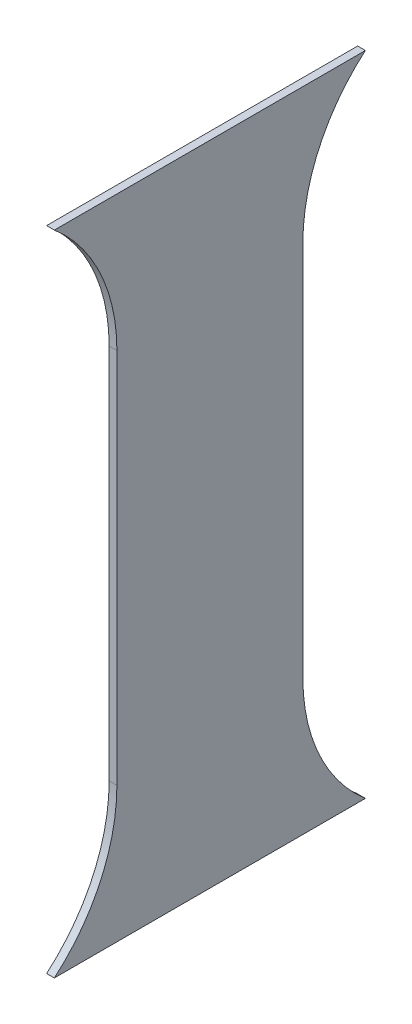
ISO-10303-21;
HEADER;
FILE_DESCRIPTION(('STEP AP214'),'2;1');
FILE_NAME('part.step','',(''),(''),'','','');
FILE_SCHEMA(('AUTOMOTIVE_DESIGN { 1 0 10303 214 1 1 1 1 }'));
ENDSEC;
DATA;
#1=APPLICATION_CONTEXT('core data for automotive mechanical design processes');
#2=APPLICATION_PROTOCOL_DEFINITION('international standard','automotive_design',2000,#1);
#3=PRODUCT_CONTEXT('',#1,'mechanical');
#4=PRODUCT('Part','Part','',(#3));
#5=PRODUCT_RELATED_PRODUCT_CATEGORY('part','',(#4));
#6=PRODUCT_DEFINITION_FORMATION('','',#4);
#7=PRODUCT_DEFINITION_CONTEXT('part definition',#1,'design');
#8=PRODUCT_DEFINITION('design','',#6,#7);
#9=PRODUCT_DEFINITION_SHAPE('','',#8);
#10=(LENGTH_UNIT() NAMED_UNIT(*) SI_UNIT(.MILLI.,.METRE.));
#11=(NAMED_UNIT(*) PLANE_ANGLE_UNIT() SI_UNIT($,.RADIAN.));
#12=(NAMED_UNIT(*) SI_UNIT($,.STERADIAN.) SOLID_ANGLE_UNIT());
#13=UNCERTAINTY_MEASURE_WITH_UNIT(LENGTH_MEASURE(1.E-05),#10,'distance_accuracy_value','');
#14=(GEOMETRIC_REPRESENTATION_CONTEXT(3) GLOBAL_UNCERTAINTY_ASSIGNED_CONTEXT((#13)) GLOBAL_UNIT_ASSIGNED_CONTEXT((#10,
#11,#12)) REPRESENTATION_CONTEXT('',''));
#15=CARTESIAN_POINT('',(0.,0.,0.));
#16=DIRECTION('',(0.,0.,1.));
#17=DIRECTION('',(1.,0.,0.));
#18=AXIS2_PLACEMENT_3D('',#15,#16,#17);
#19=CARTESIAN_POINT('',(20.,0.,460.));
#20=DIRECTION('',(-1.,0.,0.));
#21=DIRECTION('',(0.,0.,1.));
#22=AXIS2_PLACEMENT_3D('',#19,#20,#21);
#23=CYLINDRICAL_SURFACE('',#22,460.);
#24=CARTESIAN_POINT('',(0.,0.,460.));
#25=DIRECTION('',(-1.,0.,0.));
#26=DIRECTION('',(0.,0.,1.));
#27=AXIS2_PLACEMENT_3D('',#24,#25,#26);
#28=CIRCLE('',#27,460.);
#29=CARTESIAN_POINT('',(0.,0.,0.));
#30=VERTEX_POINT('',#29);
#31=CARTESIAN_POINT('',(0.,-350.,161.503768868014));
#32=VERTEX_POINT('',#31);
#33=EDGE_CURVE('E135',#30,#32,#28,.T.);
#34=ORIENTED_EDGE('',*,*,#33,.T.);
#35=DIRECTION('',(-1.,0.,0.));
#36=VECTOR('',#35,1.);
#37=CARTESIAN_POINT('',(20.,-350.,161.503768868014));
#38=LINE('',#37,#36);
#39=CARTESIAN_POINT('',(20.,-350.,161.503768868014));
#40=VERTEX_POINT('',#39);
#41=EDGE_CURVE('E59',#32,#40,#38,.F.);
#42=ORIENTED_EDGE('',*,*,#41,.T.);
#43=CARTESIAN_POINT('',(20.,0.,460.));
#44=DIRECTION('',(-1.,0.,0.));
#45=DIRECTION('',(0.,0.,1.));
#46=AXIS2_PLACEMENT_3D('',#43,#44,#45);
#47=CIRCLE('',#46,460.);
#48=CARTESIAN_POINT('',(20.,0.,0.));
#49=VERTEX_POINT('',#48);
#50=EDGE_CURVE('E115',#49,#40,#47,.T.);
#51=ORIENTED_EDGE('',*,*,#50,.F.);
#52=DIRECTION('',(-1.,0.,0.));
#53=VECTOR('',#52,1.);
#54=CARTESIAN_POINT('',(20.,0.,0.));
#55=LINE('',#54,#53);
#56=EDGE_CURVE('E134',#49,#30,#55,.T.);
#57=ORIENTED_EDGE('',*,*,#56,.T.);
#58=EDGE_LOOP('',(#34,#42,#51,#57));
#59=FACE_BOUND('',#58,.T.);
#60=ADVANCED_FACE('F38',(#59),#23,.F.);
#61=CARTESIAN_POINT('',(20.,0.,-940.));
#62=DIRECTION('',(-1.,0.,0.));
#63=DIRECTION('',(0.,0.,1.));
#64=AXIS2_PLACEMENT_3D('',#61,#62,#63);
#65=CYLINDRICAL_SURFACE('',#64,460.);
#66=CARTESIAN_POINT('',(20.,0.,-940.));
#67=DIRECTION('',(-1.,0.,0.));
#68=DIRECTION('',(0.,0.,-1.));
#69=AXIS2_PLACEMENT_3D('',#66,#67,#68);
#70=CIRCLE('',#69,460.);
#71=CARTESIAN_POINT('',(20.,-350.000000000001,-641.503768868015));
#72=VERTEX_POINT('',#71);
#73=CARTESIAN_POINT('',(20.,0.,-480.));
#74=VERTEX_POINT('',#73);
#75=EDGE_CURVE('E112',#72,#74,#70,.T.);
#76=ORIENTED_EDGE('',*,*,#75,.F.);
#77=DIRECTION('',(-1.,0.,0.));
#78=VECTOR('',#77,1.);
#79=CARTESIAN_POINT('',(20.,-350.000000000001,-641.503768868015));
#80=LINE('',#79,#78);
#81=CARTESIAN_POINT('',(0.,-350.000000000001,-641.503768868015));
#82=VERTEX_POINT('',#81);
#83=EDGE_CURVE('E99',#72,#82,#80,.T.);
#84=ORIENTED_EDGE('',*,*,#83,.T.);
#85=CARTESIAN_POINT('',(0.,0.,-940.));
#86=DIRECTION('',(-1.,0.,0.));
#87=DIRECTION('',(0.,0.,-1.));
#88=AXIS2_PLACEMENT_3D('',#85,#86,#87);
#89=CIRCLE('',#88,460.);
#90=CARTESIAN_POINT('',(0.,0.,-480.));
#91=VERTEX_POINT('',#90);
#92=EDGE_CURVE('E138',#82,#91,#89,.T.);
#93=ORIENTED_EDGE('',*,*,#92,.T.);
#94=DIRECTION('',(-1.,0.,0.));
#95=VECTOR('',#94,1.);
#96=CARTESIAN_POINT('',(20.,0.,-480.));
#97=LINE('',#96,#95);
#98=EDGE_CURVE('E119',#74,#91,#97,.T.);
#99=ORIENTED_EDGE('',*,*,#98,.F.);
#100=EDGE_LOOP('',(#76,#84,#93,#99));
#101=FACE_BOUND('',#100,.T.);
#102=ADVANCED_FACE('F117',(#101),#65,.F.);
#103=CARTESIAN_POINT('',(20.,0.,-480.));
#104=DIRECTION('',(0.,0.,1.));
#105=DIRECTION('',(1.,0.,0.));
#106=AXIS2_PLACEMENT_3D('',#103,#104,#105);
#107=PLANE('',#106);
#108=DIRECTION('',(0.,1.,0.));
#109=VECTOR('',#108,1.);
#110=CARTESIAN_POINT('',(0.,0.,-480.));
#111=LINE('',#110,#109);
#112=CARTESIAN_POINT('',(0.,972.,-480.));
#113=VERTEX_POINT('',#112);
#114=EDGE_CURVE('E140',#91,#113,#111,.T.);
#115=ORIENTED_EDGE('',*,*,#114,.T.);
#116=DIRECTION('',(-1.,0.,0.));
#117=VECTOR('',#116,1.);
#118=CARTESIAN_POINT('',(20.,972.,-480.));
#119=LINE('',#118,#117);
#120=CARTESIAN_POINT('',(20.,972.,-480.));
#121=VERTEX_POINT('',#120);
#122=EDGE_CURVE('E153',#121,#113,#119,.T.);
#123=ORIENTED_EDGE('',*,*,#122,.F.);
#124=DIRECTION('',(0.,1.,0.));
#125=VECTOR('',#124,1.);
#126=CARTESIAN_POINT('',(20.,0.,-480.));
#127=LINE('',#126,#125);
#128=EDGE_CURVE('E121',#74,#121,#127,.T.);
#129=ORIENTED_EDGE('',*,*,#128,.F.);
#130=ORIENTED_EDGE('',*,*,#98,.T.);
#131=EDGE_LOOP('',(#115,#123,#129,#130));
#132=FACE_BOUND('',#131,.T.);
#133=ADVANCED_FACE('F158',(#132),#107,.F.);
#134=CARTESIAN_POINT('',(20.,972.,-940.));
#135=DIRECTION('',(-1.,0.,0.));
#136=DIRECTION('',(0.,0.,1.));
#137=AXIS2_PLACEMENT_3D('',#134,#135,#136);
#138=CYLINDRICAL_SURFACE('',#137,460.);
#139=CARTESIAN_POINT('',(0.,972.,-940.));
#140=DIRECTION('',(-1.,0.,0.));
#141=DIRECTION('',(0.,0.,1.));
#142=AXIS2_PLACEMENT_3D('',#139,#140,#141);
#143=CIRCLE('',#142,460.);
#144=CARTESIAN_POINT('',(0.,1322.,-641.503768868014));
#145=VERTEX_POINT('',#144);
#146=EDGE_CURVE('E142',#113,#145,#143,.T.);
#147=ORIENTED_EDGE('',*,*,#146,.T.);
#148=DIRECTION('',(-1.,0.,0.));
#149=VECTOR('',#148,1.);
#150=CARTESIAN_POINT('',(20.,1322.,-641.503768868014));
#151=LINE('',#150,#149);
#152=CARTESIAN_POINT('',(20.,1322.,-641.503768868014));
#153=VERTEX_POINT('',#152);
#154=EDGE_CURVE('E51',#145,#153,#151,.F.);
#155=ORIENTED_EDGE('',*,*,#154,.T.);
#156=CARTESIAN_POINT('',(20.,972.,-940.));
#157=DIRECTION('',(-1.,0.,0.));
#158=DIRECTION('',(0.,0.,1.));
#159=AXIS2_PLACEMENT_3D('',#156,#157,#158);
#160=CIRCLE('',#159,460.);
#161=EDGE_CURVE('E123',#121,#153,#160,.T.);
#162=ORIENTED_EDGE('',*,*,#161,.F.);
#163=ORIENTED_EDGE('',*,*,#122,.T.);
#164=EDGE_LOOP('',(#147,#155,#162,#163));
#165=FACE_BOUND('',#164,.T.);
#166=ADVANCED_FACE('F165',(#165),#138,.F.);
#167=CARTESIAN_POINT('',(20.,972.,460.));
#168=DIRECTION('',(-1.,0.,0.));
#169=DIRECTION('',(0.,0.,1.));
#170=AXIS2_PLACEMENT_3D('',#167,#168,#169);
#171=CYLINDRICAL_SURFACE('',#170,460.);
#172=CARTESIAN_POINT('',(20.,972.,460.));
#173=DIRECTION('',(-1.,0.,0.));
#174=DIRECTION('',(0.,0.,-1.));
#175=AXIS2_PLACEMENT_3D('',#172,#173,#174);
#176=CIRCLE('',#175,460.);
#177=CARTESIAN_POINT('',(20.,1322.,161.503768868014));
#178=VERTEX_POINT('',#177);
#179=CARTESIAN_POINT('',(20.,972.,0.));
#180=VERTEX_POINT('',#179);
#181=EDGE_CURVE('E130',#178,#180,#176,.T.);
#182=ORIENTED_EDGE('',*,*,#181,.F.);
#183=DIRECTION('',(-1.,0.,0.));
#184=VECTOR('',#183,1.);
#185=CARTESIAN_POINT('',(20.,1322.,161.503768868014));
#186=LINE('',#185,#184);
#187=CARTESIAN_POINT('',(0.,1322.,161.503768868014));
#188=VERTEX_POINT('',#187);
#189=EDGE_CURVE('E174',#178,#188,#186,.T.);
#190=ORIENTED_EDGE('',*,*,#189,.T.);
#191=CARTESIAN_POINT('',(0.,972.,460.));
#192=DIRECTION('',(-1.,0.,0.));
#193=DIRECTION('',(0.,0.,-1.));
#194=AXIS2_PLACEMENT_3D('',#191,#192,#193);
#195=CIRCLE('',#194,460.);
#196=CARTESIAN_POINT('',(0.,972.,0.));
#197=VERTEX_POINT('',#196);
#198=EDGE_CURVE('E145',#188,#197,#195,.T.);
#199=ORIENTED_EDGE('',*,*,#198,.T.);
#200=DIRECTION('',(-1.,0.,0.));
#201=VECTOR('',#200,1.);
#202=CARTESIAN_POINT('',(20.,972.,0.));
#203=LINE('',#202,#201);
#204=EDGE_CURVE('E150',#180,#197,#203,.T.);
#205=ORIENTED_EDGE('',*,*,#204,.F.);
#206=EDGE_LOOP('',(#182,#190,#199,#205));
#207=FACE_BOUND('',#206,.T.);
#208=ADVANCED_FACE('F173',(#207),#171,.F.);
#209=CARTESIAN_POINT('',(20.,0.,0.));
#210=DIRECTION('',(0.,0.,-1.));
#211=DIRECTION('',(-1.,0.,0.));
#212=AXIS2_PLACEMENT_3D('',#209,#210,#211);
#213=PLANE('',#212);
#214=DIRECTION('',(0.,-1.,0.));
#215=VECTOR('',#214,1.);
#216=CARTESIAN_POINT('',(0.,0.,0.));
#217=LINE('',#216,#215);
#218=EDGE_CURVE('E125',#197,#30,#217,.T.);
#219=ORIENTED_EDGE('',*,*,#218,.T.);
#220=ORIENTED_EDGE('',*,*,#56,.F.);
#221=DIRECTION('',(0.,-1.,0.));
#222=VECTOR('',#221,1.);
#223=CARTESIAN_POINT('',(20.,0.,0.));
#224=LINE('',#223,#222);
#225=EDGE_CURVE('E132',#180,#49,#224,.T.);
#226=ORIENTED_EDGE('',*,*,#225,.F.);
#227=ORIENTED_EDGE('',*,*,#204,.T.);
#228=EDGE_LOOP('',(#219,#220,#226,#227));
#229=FACE_BOUND('',#228,.T.);
#230=ADVANCED_FACE('F179',(#229),#213,.F.);
#231=CARTESIAN_POINT('',(20.,0.,460.));
#232=DIRECTION('',(-1.,0.,0.));
#233=DIRECTION('',(0.,0.,1.));
#234=AXIS2_PLACEMENT_3D('',#231,#232,#233);
#235=PLANE('',#234);
#236=ORIENTED_EDGE('',*,*,#161,.T.);
#237=DIRECTION('',(0.,0.,-1.));
#238=VECTOR('',#237,1.);
#239=CARTESIAN_POINT('',(20.,1322.,460.));
#240=LINE('',#239,#238);
#241=EDGE_CURVE('E106',#178,#153,#240,.T.);
#242=ORIENTED_EDGE('',*,*,#241,.F.);
#243=ORIENTED_EDGE('',*,*,#181,.T.);
#244=ORIENTED_EDGE('',*,*,#225,.T.);
#245=ORIENTED_EDGE('',*,*,#50,.T.);
#246=DIRECTION('',(0.,0.,1.));
#247=VECTOR('',#246,1.);
#248=CARTESIAN_POINT('',(20.,-350.,460.000000000001));
#249=LINE('',#248,#247);
#250=EDGE_CURVE('E102',#72,#40,#249,.T.);
#251=ORIENTED_EDGE('',*,*,#250,.F.);
#252=ORIENTED_EDGE('',*,*,#75,.T.);
#253=ORIENTED_EDGE('',*,*,#128,.T.);
#254=EDGE_LOOP('',(#236,#242,#243,#244,#245,#251,#252,#253));
#255=FACE_BOUND('',#254,.T.);
#256=ADVANCED_FACE('F111',(#255),#235,.F.);
#257=CARTESIAN_POINT('',(0.,0.,460.));
#258=DIRECTION('',(-1.,0.,0.));
#259=DIRECTION('',(0.,0.,1.));
#260=AXIS2_PLACEMENT_3D('',#257,#258,#259);
#261=PLANE('',#260);
#262=DIRECTION('',(0.,0.,1.));
#263=VECTOR('',#262,1.);
#264=CARTESIAN_POINT('',(0.,1322.,460.));
#265=LINE('',#264,#263);
#266=EDGE_CURVE('E11',#145,#188,#265,.T.);
#267=ORIENTED_EDGE('',*,*,#266,.F.);
#268=ORIENTED_EDGE('',*,*,#146,.F.);
#269=ORIENTED_EDGE('',*,*,#114,.F.);
#270=ORIENTED_EDGE('',*,*,#92,.F.);
#271=DIRECTION('',(0.,0.,-1.));
#272=VECTOR('',#271,1.);
#273=CARTESIAN_POINT('',(0.,-350.,460.));
#274=LINE('',#273,#272);
#275=EDGE_CURVE('E45',#32,#82,#274,.T.);
#276=ORIENTED_EDGE('',*,*,#275,.F.);
#277=ORIENTED_EDGE('',*,*,#33,.F.);
#278=ORIENTED_EDGE('',*,*,#218,.F.);
#279=ORIENTED_EDGE('',*,*,#198,.F.);
#280=EDGE_LOOP('',(#267,#268,#269,#270,#276,#277,#278,#279));
#281=FACE_BOUND('',#280,.T.);
#282=ADVANCED_FACE('F162',(#281),#261,.T.);
#283=CARTESIAN_POINT('',(0.,-350.,460.000000000001));
#284=DIRECTION('',(0.,1.,0.));
#285=DIRECTION('',(0.,0.,1.));
#286=AXIS2_PLACEMENT_3D('',#283,#284,#285);
#287=PLANE('',#286);
#288=ORIENTED_EDGE('',*,*,#275,.T.);
#289=ORIENTED_EDGE('',*,*,#83,.F.);
#290=ORIENTED_EDGE('',*,*,#250,.T.);
#291=ORIENTED_EDGE('',*,*,#41,.F.);
#292=EDGE_LOOP('',(#288,#289,#290,#291));
#293=FACE_BOUND('',#292,.T.);
#294=ADVANCED_FACE('F101',(#293),#287,.F.);
#295=CARTESIAN_POINT('',(0.,1322.,460.));
#296=DIRECTION('',(0.,-1.,0.));
#297=DIRECTION('',(0.,0.,-1.));
#298=AXIS2_PLACEMENT_3D('',#295,#296,#297);
#299=PLANE('',#298);
#300=ORIENTED_EDGE('',*,*,#266,.T.);
#301=ORIENTED_EDGE('',*,*,#189,.F.);
#302=ORIENTED_EDGE('',*,*,#241,.T.);
#303=ORIENTED_EDGE('',*,*,#154,.F.);
#304=EDGE_LOOP('',(#300,#301,#302,#303));
#305=FACE_BOUND('',#304,.T.);
#306=ADVANCED_FACE('F206',(#305),#299,.F.);
#307=CLOSED_SHELL('',(#60,#102,#133,#166,#208,#230,#256,#282,#294,#306));
#308=MANIFOLD_SOLID_BREP('B2',#307);
#309=ADVANCED_BREP_SHAPE_REPRESENTATION('',(#18,#308),#14);
#310=SHAPE_DEFINITION_REPRESENTATION(#9,#309);
ENDSEC;
END-ISO-10303-21;
